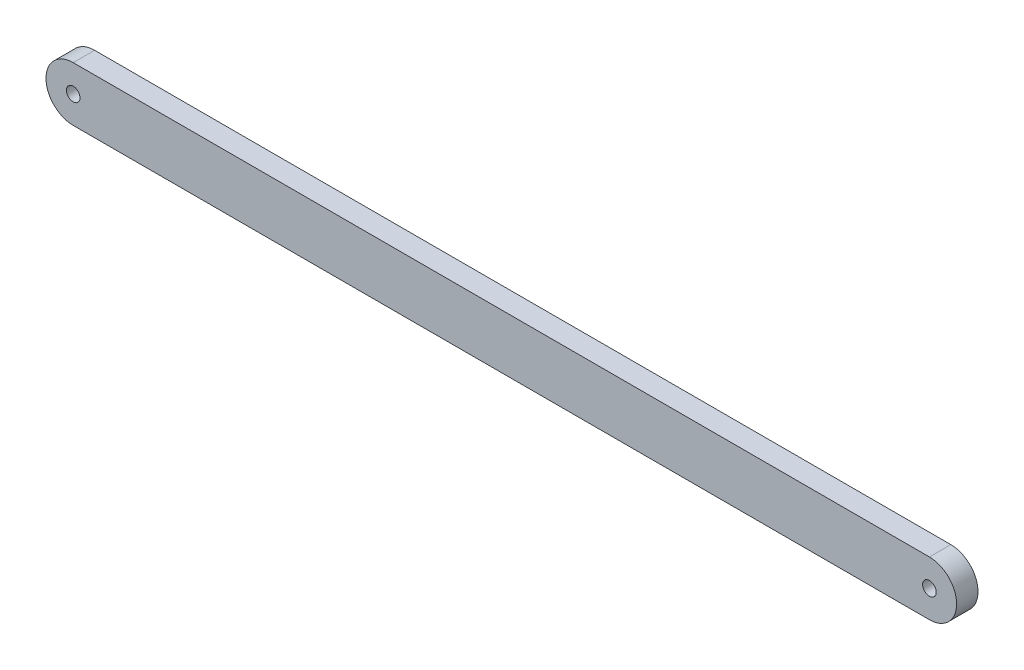
ISO-10303-21;
HEADER;
FILE_DESCRIPTION(('STEP AP214'),'2;1');
FILE_NAME('part.step','',(''),(''),'','','');
FILE_SCHEMA(('AUTOMOTIVE_DESIGN { 1 0 10303 214 1 1 1 1 }'));
ENDSEC;
DATA;
#1=APPLICATION_CONTEXT('core data for automotive mechanical design processes');
#2=APPLICATION_PROTOCOL_DEFINITION('international standard','automotive_design',2000,#1);
#3=PRODUCT_CONTEXT('',#1,'mechanical');
#4=PRODUCT('Part','Part','',(#3));
#5=PRODUCT_RELATED_PRODUCT_CATEGORY('part','',(#4));
#6=PRODUCT_DEFINITION_FORMATION('','',#4);
#7=PRODUCT_DEFINITION_CONTEXT('part definition',#1,'design');
#8=PRODUCT_DEFINITION('design','',#6,#7);
#9=PRODUCT_DEFINITION_SHAPE('','',#8);
#10=(LENGTH_UNIT() NAMED_UNIT(*) SI_UNIT(.MILLI.,.METRE.));
#11=(NAMED_UNIT(*) PLANE_ANGLE_UNIT() SI_UNIT($,.RADIAN.));
#12=(NAMED_UNIT(*) SI_UNIT($,.STERADIAN.) SOLID_ANGLE_UNIT());
#13=UNCERTAINTY_MEASURE_WITH_UNIT(LENGTH_MEASURE(1.E-05),#10,'distance_accuracy_value','');
#14=(GEOMETRIC_REPRESENTATION_CONTEXT(3) GLOBAL_UNCERTAINTY_ASSIGNED_CONTEXT((#13)) GLOBAL_UNIT_ASSIGNED_CONTEXT((#10,
#11,#12)) REPRESENTATION_CONTEXT('',''));
#15=CARTESIAN_POINT('',(0.,0.,0.));
#16=DIRECTION('',(0.,0.,1.));
#17=DIRECTION('',(1.,0.,0.));
#18=AXIS2_PLACEMENT_3D('',#15,#16,#17);
#19=CARTESIAN_POINT('',(0.,0.,10.));
#20=DIRECTION('',(0.,0.,1.));
#21=DIRECTION('',(1.,0.,0.));
#22=AXIS2_PLACEMENT_3D('',#19,#20,#21);
#23=PLANE('',#22);
#24=CARTESIAN_POINT('',(400.,0.,10.));
#25=DIRECTION('',(0.,0.,1.));
#26=DIRECTION('',(1.,0.,0.));
#27=AXIS2_PLACEMENT_3D('',#24,#25,#26);
#28=CIRCLE('',#27,3.17499999999997);
#29=CARTESIAN_POINT('',(403.175,0.,10.));
#30=VERTEX_POINT('',#29);
#31=EDGE_CURVE('E100',#30,#30,#28,.T.);
#32=ORIENTED_EDGE('',*,*,#31,.F.);
#33=EDGE_LOOP('',(#32));
#34=FACE_BOUND('',#33,.T.);
#35=CARTESIAN_POINT('',(0.,0.,10.));
#36=DIRECTION('',(0.,0.,1.));
#37=DIRECTION('',(1.,0.,0.));
#38=AXIS2_PLACEMENT_3D('',#35,#36,#37);
#39=CIRCLE('',#38,12.7);
#40=CARTESIAN_POINT('',(0.,12.7,10.));
#41=VERTEX_POINT('',#40);
#42=CARTESIAN_POINT('',(0.,-12.7,10.));
#43=VERTEX_POINT('',#42);
#44=EDGE_CURVE('E85',#41,#43,#39,.T.);
#45=ORIENTED_EDGE('',*,*,#44,.T.);
#46=DIRECTION('',(1.,0.,0.));
#47=VECTOR('',#46,1.);
#48=CARTESIAN_POINT('',(0.,-12.7,10.));
#49=LINE('',#48,#47);
#50=CARTESIAN_POINT('',(400.,-12.7,10.));
#51=VERTEX_POINT('',#50);
#52=EDGE_CURVE('E80',#43,#51,#49,.T.);
#53=ORIENTED_EDGE('',*,*,#52,.T.);
#54=CARTESIAN_POINT('',(400.,0.,10.));
#55=DIRECTION('',(0.,0.,1.));
#56=DIRECTION('',(1.,0.,0.));
#57=AXIS2_PLACEMENT_3D('',#54,#55,#56);
#58=CIRCLE('',#57,12.7);
#59=CARTESIAN_POINT('',(400.,12.7,10.));
#60=VERTEX_POINT('',#59);
#61=EDGE_CURVE('E83',#51,#60,#58,.T.);
#62=ORIENTED_EDGE('',*,*,#61,.T.);
#63=DIRECTION('',(-1.,0.,0.));
#64=VECTOR('',#63,1.);
#65=CARTESIAN_POINT('',(0.,12.7,10.));
#66=LINE('',#65,#64);
#67=EDGE_CURVE('E50',#60,#41,#66,.T.);
#68=ORIENTED_EDGE('',*,*,#67,.T.);
#69=EDGE_LOOP('',(#45,#53,#62,#68));
#70=FACE_BOUND('',#69,.T.);
#71=CARTESIAN_POINT('',(0.,0.,10.));
#72=DIRECTION('',(0.,0.,1.));
#73=DIRECTION('',(1.,0.,0.));
#74=AXIS2_PLACEMENT_3D('',#71,#72,#73);
#75=CIRCLE('',#74,3.175);
#76=CARTESIAN_POINT('',(3.175,0.,10.));
#77=VERTEX_POINT('',#76);
#78=EDGE_CURVE('E115',#77,#77,#75,.T.);
#79=ORIENTED_EDGE('',*,*,#78,.F.);
#80=EDGE_LOOP('',(#79));
#81=FACE_BOUND('',#80,.T.);
#82=ADVANCED_FACE('F33',(#34,#70,#81),#23,.T.);
#83=CARTESIAN_POINT('',(0.,0.,0.));
#84=DIRECTION('',(0.,0.,1.));
#85=DIRECTION('',(1.,0.,0.));
#86=AXIS2_PLACEMENT_3D('',#83,#84,#85);
#87=PLANE('',#86);
#88=CARTESIAN_POINT('',(400.,0.,0.));
#89=DIRECTION('',(0.,0.,1.));
#90=DIRECTION('',(1.,0.,0.));
#91=AXIS2_PLACEMENT_3D('',#88,#89,#90);
#92=CIRCLE('',#91,3.17499999999997);
#93=CARTESIAN_POINT('',(403.175,0.,0.));
#94=VERTEX_POINT('',#93);
#95=EDGE_CURVE('E112',#94,#94,#92,.T.);
#96=ORIENTED_EDGE('',*,*,#95,.T.);
#97=EDGE_LOOP('',(#96));
#98=FACE_BOUND('',#97,.T.);
#99=CARTESIAN_POINT('',(0.,0.,0.));
#100=DIRECTION('',(0.,0.,1.));
#101=DIRECTION('',(1.,0.,0.));
#102=AXIS2_PLACEMENT_3D('',#99,#100,#101);
#103=CIRCLE('',#102,12.7);
#104=CARTESIAN_POINT('',(0.,12.7,0.));
#105=VERTEX_POINT('',#104);
#106=CARTESIAN_POINT('',(0.,-12.7,0.));
#107=VERTEX_POINT('',#106);
#108=EDGE_CURVE('E97',#105,#107,#103,.T.);
#109=ORIENTED_EDGE('',*,*,#108,.F.);
#110=DIRECTION('',(-1.,0.,0.));
#111=VECTOR('',#110,1.);
#112=CARTESIAN_POINT('',(0.,12.7,0.));
#113=LINE('',#112,#111);
#114=CARTESIAN_POINT('',(400.,12.7,0.));
#115=VERTEX_POINT('',#114);
#116=EDGE_CURVE('E73',#115,#105,#113,.T.);
#117=ORIENTED_EDGE('',*,*,#116,.F.);
#118=CARTESIAN_POINT('',(400.,0.,0.));
#119=DIRECTION('',(0.,0.,1.));
#120=DIRECTION('',(1.,0.,0.));
#121=AXIS2_PLACEMENT_3D('',#118,#119,#120);
#122=CIRCLE('',#121,12.7);
#123=CARTESIAN_POINT('',(400.,-12.7,0.));
#124=VERTEX_POINT('',#123);
#125=EDGE_CURVE('E67',#124,#115,#122,.T.);
#126=ORIENTED_EDGE('',*,*,#125,.F.);
#127=DIRECTION('',(1.,0.,0.));
#128=VECTOR('',#127,1.);
#129=CARTESIAN_POINT('',(0.,-12.7,0.));
#130=LINE('',#129,#128);
#131=EDGE_CURVE('E89',#107,#124,#130,.T.);
#132=ORIENTED_EDGE('',*,*,#131,.F.);
#133=EDGE_LOOP('',(#109,#117,#126,#132));
#134=FACE_BOUND('',#133,.T.);
#135=CARTESIAN_POINT('',(0.,0.,0.));
#136=DIRECTION('',(0.,0.,1.));
#137=DIRECTION('',(1.,0.,0.));
#138=AXIS2_PLACEMENT_3D('',#135,#136,#137);
#139=CIRCLE('',#138,3.175);
#140=CARTESIAN_POINT('',(3.175,0.,0.));
#141=VERTEX_POINT('',#140);
#142=EDGE_CURVE('E118',#141,#141,#139,.T.);
#143=ORIENTED_EDGE('',*,*,#142,.T.);
#144=EDGE_LOOP('',(#143));
#145=FACE_BOUND('',#144,.T.);
#146=ADVANCED_FACE('F108',(#98,#134,#145),#87,.F.);
#147=CARTESIAN_POINT('',(0.,0.,10.));
#148=DIRECTION('',(0.,0.,-1.));
#149=DIRECTION('',(-1.,0.,0.));
#150=AXIS2_PLACEMENT_3D('',#147,#148,#149);
#151=CYLINDRICAL_SURFACE('',#150,12.7);
#152=ORIENTED_EDGE('',*,*,#108,.T.);
#153=DIRECTION('',(0.,0.,-1.));
#154=VECTOR('',#153,1.);
#155=CARTESIAN_POINT('',(0.,-12.7,10.));
#156=LINE('',#155,#154);
#157=EDGE_CURVE('E11',#43,#107,#156,.T.);
#158=ORIENTED_EDGE('',*,*,#157,.F.);
#159=ORIENTED_EDGE('',*,*,#44,.F.);
#160=DIRECTION('',(0.,0.,-1.));
#161=VECTOR('',#160,1.);
#162=CARTESIAN_POINT('',(0.,12.7,10.));
#163=LINE('',#162,#161);
#164=EDGE_CURVE('E93',#41,#105,#163,.T.);
#165=ORIENTED_EDGE('',*,*,#164,.T.);
#166=EDGE_LOOP('',(#152,#158,#159,#165));
#167=FACE_BOUND('',#166,.T.);
#168=ADVANCED_FACE('F35',(#167),#151,.T.);
#169=CARTESIAN_POINT('',(0.,-12.7,10.));
#170=DIRECTION('',(0.,1.,0.));
#171=DIRECTION('',(0.,0.,1.));
#172=AXIS2_PLACEMENT_3D('',#169,#170,#171);
#173=PLANE('',#172);
#174=ORIENTED_EDGE('',*,*,#131,.T.);
#175=DIRECTION('',(0.,0.,-1.));
#176=VECTOR('',#175,1.);
#177=CARTESIAN_POINT('',(400.,-12.7,10.));
#178=LINE('',#177,#176);
#179=EDGE_CURVE('E42',#51,#124,#178,.T.);
#180=ORIENTED_EDGE('',*,*,#179,.F.);
#181=ORIENTED_EDGE('',*,*,#52,.F.);
#182=ORIENTED_EDGE('',*,*,#157,.T.);
#183=EDGE_LOOP('',(#174,#180,#181,#182));
#184=FACE_BOUND('',#183,.T.);
#185=ADVANCED_FACE('F88',(#184),#173,.F.);
#186=CARTESIAN_POINT('',(400.,0.,10.));
#187=DIRECTION('',(0.,0.,-1.));
#188=DIRECTION('',(-1.,0.,0.));
#189=AXIS2_PLACEMENT_3D('',#186,#187,#188);
#190=CYLINDRICAL_SURFACE('',#189,12.7);
#191=ORIENTED_EDGE('',*,*,#125,.T.);
#192=DIRECTION('',(0.,0.,-1.));
#193=VECTOR('',#192,1.);
#194=CARTESIAN_POINT('',(400.,12.7,10.));
#195=LINE('',#194,#193);
#196=EDGE_CURVE('E90',#60,#115,#195,.T.);
#197=ORIENTED_EDGE('',*,*,#196,.F.);
#198=ORIENTED_EDGE('',*,*,#61,.F.);
#199=ORIENTED_EDGE('',*,*,#179,.T.);
#200=EDGE_LOOP('',(#191,#197,#198,#199));
#201=FACE_BOUND('',#200,.T.);
#202=ADVANCED_FACE('F91',(#201),#190,.T.);
#203=CARTESIAN_POINT('',(0.,12.7,10.));
#204=DIRECTION('',(0.,-1.,0.));
#205=DIRECTION('',(1.,0.,0.));
#206=AXIS2_PLACEMENT_3D('',#203,#204,#205);
#207=PLANE('',#206);
#208=ORIENTED_EDGE('',*,*,#116,.T.);
#209=ORIENTED_EDGE('',*,*,#164,.F.);
#210=ORIENTED_EDGE('',*,*,#67,.F.);
#211=ORIENTED_EDGE('',*,*,#196,.T.);
#212=EDGE_LOOP('',(#208,#209,#210,#211));
#213=FACE_BOUND('',#212,.T.);
#214=ADVANCED_FACE('F105',(#213),#207,.F.);
#215=CARTESIAN_POINT('',(400.,0.,10.));
#216=DIRECTION('',(0.,0.,-1.));
#217=DIRECTION('',(-1.,0.,0.));
#218=AXIS2_PLACEMENT_3D('',#215,#216,#217);
#219=CYLINDRICAL_SURFACE('',#218,3.17499999999997);
#220=ORIENTED_EDGE('',*,*,#31,.T.);
#221=EDGE_LOOP('',(#220));
#222=FACE_BOUND('',#221,.T.);
#223=ORIENTED_EDGE('',*,*,#95,.F.);
#224=EDGE_LOOP('',(#223));
#225=FACE_BOUND('',#224,.T.);
#226=ADVANCED_FACE('F136',(#222,#225),#219,.F.);
#227=CARTESIAN_POINT('',(0.,0.,10.));
#228=DIRECTION('',(0.,0.,-1.));
#229=DIRECTION('',(-1.,0.,0.));
#230=AXIS2_PLACEMENT_3D('',#227,#228,#229);
#231=CYLINDRICAL_SURFACE('',#230,3.175);
#232=ORIENTED_EDGE('',*,*,#78,.T.);
#233=EDGE_LOOP('',(#232));
#234=FACE_BOUND('',#233,.T.);
#235=ORIENTED_EDGE('',*,*,#142,.F.);
#236=EDGE_LOOP('',(#235));
#237=FACE_BOUND('',#236,.T.);
#238=ADVANCED_FACE('F124',(#234,#237),#231,.F.);
#239=CLOSED_SHELL('',(#82,#146,#168,#185,#202,#214,#226,#238));
#240=MANIFOLD_SOLID_BREP('B2',#239);
#241=ADVANCED_BREP_SHAPE_REPRESENTATION('',(#18,#240),#14);
#242=SHAPE_DEFINITION_REPRESENTATION(#9,#241);
ENDSEC;
END-ISO-10303-21;
